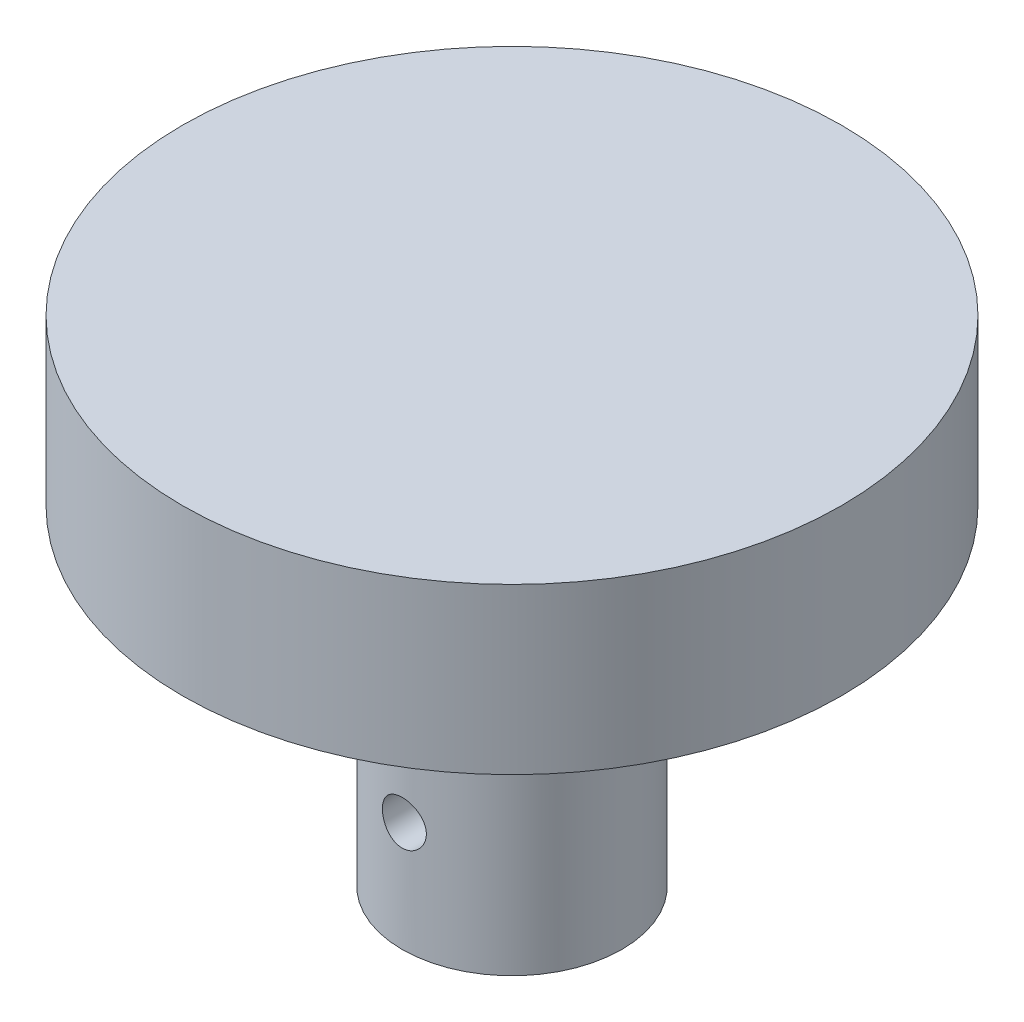
ISO-10303-21;
HEADER;
FILE_DESCRIPTION(('STEP AP214'),'2;1');
FILE_NAME('part.step','',(''),(''),'','','');
FILE_SCHEMA(('AUTOMOTIVE_DESIGN { 1 0 10303 214 1 1 1 1 }'));
ENDSEC;
DATA;
#1=APPLICATION_CONTEXT('core data for automotive mechanical design processes');
#2=APPLICATION_PROTOCOL_DEFINITION('international standard','automotive_design',2000,#1);
#3=PRODUCT_CONTEXT('',#1,'mechanical');
#4=PRODUCT('Part','Part','',(#3));
#5=PRODUCT_RELATED_PRODUCT_CATEGORY('part','',(#4));
#6=PRODUCT_DEFINITION_FORMATION('','',#4);
#7=PRODUCT_DEFINITION_CONTEXT('part definition',#1,'design');
#8=PRODUCT_DEFINITION('design','',#6,#7);
#9=PRODUCT_DEFINITION_SHAPE('','',#8);
#10=(LENGTH_UNIT() NAMED_UNIT(*) SI_UNIT(.MILLI.,.METRE.));
#11=(NAMED_UNIT(*) PLANE_ANGLE_UNIT() SI_UNIT($,.RADIAN.));
#12=(NAMED_UNIT(*) SI_UNIT($,.STERADIAN.) SOLID_ANGLE_UNIT());
#13=UNCERTAINTY_MEASURE_WITH_UNIT(LENGTH_MEASURE(1.E-05),#10,'distance_accuracy_value','');
#14=(GEOMETRIC_REPRESENTATION_CONTEXT(3) GLOBAL_UNCERTAINTY_ASSIGNED_CONTEXT((#13)) GLOBAL_UNIT_ASSIGNED_CONTEXT((#10,
#11,#12)) REPRESENTATION_CONTEXT('',''));
#15=CARTESIAN_POINT('',(0.,0.,0.));
#16=DIRECTION('',(0.,0.,1.));
#17=DIRECTION('',(1.,0.,0.));
#18=AXIS2_PLACEMENT_3D('',#15,#16,#17);
#19=CARTESIAN_POINT('',(0.,9.525,0.));
#20=DIRECTION('',(0.,-1.,0.));
#21=DIRECTION('',(0.,0.,-1.));
#22=AXIS2_PLACEMENT_3D('',#19,#20,#21);
#23=CYLINDRICAL_SURFACE('',#22,19.05);
#24=CARTESIAN_POINT('',(0.,9.525,0.));
#25=DIRECTION('',(0.,1.,0.));
#26=DIRECTION('',(0.,0.,1.));
#27=AXIS2_PLACEMENT_3D('',#24,#25,#26);
#28=CIRCLE('',#27,19.05);
#29=CARTESIAN_POINT('',(0.,9.525,19.05));
#30=VERTEX_POINT('',#29);
#31=EDGE_CURVE('E37',#30,#30,#28,.T.);
#32=ORIENTED_EDGE('',*,*,#31,.F.);
#33=EDGE_LOOP('',(#32));
#34=FACE_BOUND('',#33,.T.);
#35=CARTESIAN_POINT('',(0.,0.,0.));
#36=DIRECTION('',(0.,1.,0.));
#37=DIRECTION('',(0.,0.,1.));
#38=AXIS2_PLACEMENT_3D('',#35,#36,#37);
#39=CIRCLE('',#38,19.05);
#40=CARTESIAN_POINT('',(0.,0.,19.05));
#41=VERTEX_POINT('',#40);
#42=EDGE_CURVE('E41',#41,#41,#39,.T.);
#43=ORIENTED_EDGE('',*,*,#42,.T.);
#44=EDGE_LOOP('',(#43));
#45=FACE_BOUND('',#44,.T.);
#46=ADVANCED_FACE('F31',(#34,#45),#23,.T.);
#47=CARTESIAN_POINT('',(0.,9.525,0.));
#48=DIRECTION('',(0.,1.,0.));
#49=DIRECTION('',(0.,0.,1.));
#50=AXIS2_PLACEMENT_3D('',#47,#48,#49);
#51=PLANE('',#50);
#52=ORIENTED_EDGE('',*,*,#31,.T.);
#53=EDGE_LOOP('',(#52));
#54=FACE_BOUND('',#53,.T.);
#55=ADVANCED_FACE('F93',(#54),#51,.T.);
#56=CARTESIAN_POINT('',(0.,0.,0.));
#57=DIRECTION('',(0.,1.,0.));
#58=DIRECTION('',(0.,0.,1.));
#59=AXIS2_PLACEMENT_3D('',#56,#57,#58);
#60=PLANE('',#59);
#61=CARTESIAN_POINT('',(0.,0.,0.));
#62=DIRECTION('',(0.,1.,0.));
#63=DIRECTION('',(0.,0.,1.));
#64=AXIS2_PLACEMENT_3D('',#61,#62,#63);
#65=CIRCLE('',#64,6.35);
#66=CARTESIAN_POINT('',(0.,0.,6.35));
#67=VERTEX_POINT('',#66);
#68=EDGE_CURVE('E10',#67,#67,#65,.F.);
#69=ORIENTED_EDGE('',*,*,#68,.F.);
#70=EDGE_LOOP('',(#69));
#71=FACE_BOUND('',#70,.T.);
#72=ORIENTED_EDGE('',*,*,#42,.F.);
#73=EDGE_LOOP('',(#72));
#74=FACE_BOUND('',#73,.T.);
#75=ADVANCED_FACE('F86',(#71,#74),#60,.F.);
#76=CARTESIAN_POINT('',(0.,-19.05,0.));
#77=DIRECTION('',(0.,-1.,0.));
#78=DIRECTION('',(0.,0.,-1.));
#79=AXIS2_PLACEMENT_3D('',#76,#77,#78);
#80=PLANE('',#79);
#81=CARTESIAN_POINT('',(0.,-19.05,0.));
#82=DIRECTION('',(0.,-1.,0.));
#83=DIRECTION('',(0.,0.,-1.));
#84=AXIS2_PLACEMENT_3D('',#81,#82,#83);
#85=CIRCLE('',#84,6.35);
#86=CARTESIAN_POINT('',(0.,-19.05,-6.35));
#87=VERTEX_POINT('',#86);
#88=EDGE_CURVE('E46',#87,#87,#85,.T.);
#89=ORIENTED_EDGE('',*,*,#88,.T.);
#90=EDGE_LOOP('',(#89));
#91=FACE_BOUND('',#90,.T.);
#92=CARTESIAN_POINT('',(0.,-19.05,0.));
#93=DIRECTION('',(0.,-1.,0.));
#94=DIRECTION('',(0.,0.,-1.));
#95=AXIS2_PLACEMENT_3D('',#92,#93,#94);
#96=CIRCLE('',#95,3.5);
#97=CARTESIAN_POINT('',(0.,-19.05,-3.5));
#98=VERTEX_POINT('',#97);
#99=EDGE_CURVE('E50',#98,#98,#96,.T.);
#100=ORIENTED_EDGE('',*,*,#99,.F.);
#101=EDGE_LOOP('',(#100));
#102=FACE_BOUND('',#101,.T.);
#103=ADVANCED_FACE('F84',(#91,#102),#80,.T.);
#104=CARTESIAN_POINT('',(0.,-19.05,0.));
#105=DIRECTION('',(0.,1.,0.));
#106=DIRECTION('',(0.,0.,1.));
#107=AXIS2_PLACEMENT_3D('',#104,#105,#106);
#108=CYLINDRICAL_SURFACE('',#107,6.35);
#109=CARTESIAN_POINT('',(0.,-13.97,6.35));
#110=CARTESIAN_POINT('',(-0.0705826716266443,-13.9699974034871,6.34999869927706));
#111=CARTESIAN_POINT('',(-0.141198168455934,-13.9640959694311,6.34881109176353));
#112=CARTESIAN_POINT('',(-0.280433154765055,-13.9406649048536,6.34418804341504));
#113=CARTESIAN_POINT('',(-0.349051013277522,-13.9231260363421,6.34075081682436));
#114=CARTESIAN_POINT('',(-0.482257487684408,-13.8769835825016,6.33201234583424));
#115=CARTESIAN_POINT('',(-0.546849894275082,-13.8483905952072,6.32671288727432));
#116=CARTESIAN_POINT('',(-0.670316145857568,-13.7809830456607,6.31482605504849));
#117=CARTESIAN_POINT('',(-0.729190331146282,-13.7421690921788,6.30823875809348));
#118=CARTESIAN_POINT('',(-0.84035071618988,-13.6548641122499,6.29440149969062));
#119=CARTESIAN_POINT('',(-0.892548317971327,-13.6062613886532,6.28714446790521));
#120=CARTESIAN_POINT('',(-0.988106680892197,-13.5009986311825,6.27283709174787));
#121=CARTESIAN_POINT('',(-1.03146675185844,-13.4443379686044,6.26578676355538));
#122=CARTESIAN_POINT('',(-1.10849632675148,-13.3239304348749,6.25262201102021));
#123=CARTESIAN_POINT('',(-1.14207409235965,-13.2601237923786,6.24651668353481));
#124=CARTESIAN_POINT('',(-1.19799819655699,-13.1276320898648,6.2360336043419));
#125=CARTESIAN_POINT('',(-1.22034564469529,-13.0589475125501,6.23165568197691));
#126=CARTESIAN_POINT('',(-1.25288713085373,-12.9196028578369,6.225194626703));
#127=CARTESIAN_POINT('',(-1.26323661240765,-12.8489804689394,6.22308217036128));
#128=CARTESIAN_POINT('',(-1.27197120221217,-12.7069725268673,6.22130296326996));
#129=CARTESIAN_POINT('',(-1.27035753384615,-12.6355870524734,6.22163596244158));
#130=CARTESIAN_POINT('',(-1.25533730783931,-12.4952165792133,6.22468339958194));
#131=CARTESIAN_POINT('',(-1.24210894610976,-12.4262116148533,6.2273618513063));
#132=CARTESIAN_POINT('',(-1.20451611347127,-12.291420582638,6.23474173623202));
#133=CARTESIAN_POINT('',(-1.18015111073787,-12.2256346686729,6.23944326604379));
#134=CARTESIAN_POINT('',(-1.12080647526689,-12.0986356176364,6.25037635495518));
#135=CARTESIAN_POINT('',(-1.08575621206479,-12.0374563929472,6.25661804063405));
#136=CARTESIAN_POINT('',(-1.0060858397073,-11.9217810205345,6.26992165841789));
#137=CARTESIAN_POINT('',(-0.961464630733174,-11.867285641999,6.27698368474725));
#138=CARTESIAN_POINT('',(-0.862964916891943,-11.7654966588797,6.29128816976656));
#139=CARTESIAN_POINT('',(-0.808934324739806,-11.7183502388189,6.29853158897849));
#140=CARTESIAN_POINT('',(-0.693654980558753,-11.6337666151974,6.31226637867299));
#141=CARTESIAN_POINT('',(-0.632406135971824,-11.5963295361572,6.31875773950996));
#142=CARTESIAN_POINT('',(-0.504265421336229,-11.532200063283,6.33027296504327));
#143=CARTESIAN_POINT('',(-0.43736491087333,-11.5055244950714,6.33529452837305));
#144=CARTESIAN_POINT('',(-0.299909200089804,-11.463832197971,6.3432868941458));
#145=CARTESIAN_POINT('',(-0.229354443592011,-11.4488140567665,6.34625794500675));
#146=CARTESIAN_POINT('',(-0.0878578451464813,-11.4310713036813,6.34977993270922));
#147=CARTESIAN_POINT('',(-0.0169422169734818,-11.4281452671839,6.35037051808637));
#148=CARTESIAN_POINT('',(0.124364666424747,-11.4341273208566,6.3491751595123));
#149=CARTESIAN_POINT('',(0.194755950903618,-11.4430347457778,6.34738934915636));
#150=CARTESIAN_POINT('',(0.332366188132107,-11.4722635344008,6.34166666650182));
#151=CARTESIAN_POINT('',(0.399607974391677,-11.4924815469923,6.33774928033342));
#152=CARTESIAN_POINT('',(0.529747006924577,-11.5436446579729,6.32820111117511));
#153=CARTESIAN_POINT('',(0.592643927279676,-11.5745905600396,6.32257019982068));
#154=CARTESIAN_POINT('',(0.713157290581496,-11.6467667631272,6.31012087647284));
#155=CARTESIAN_POINT('',(0.770699660975278,-11.6881183319195,6.30328877055056));
#156=CARTESIAN_POINT('',(0.878100884281392,-11.7797696728332,6.28922713233951));
#157=CARTESIAN_POINT('',(0.927958912342069,-11.8300704043278,6.28199755749853));
#158=CARTESIAN_POINT('',(1.0193535502832,-11.9391091569017,6.26782215517346));
#159=CARTESIAN_POINT('',(1.06075188210979,-11.9979639951611,6.26088232496296));
#160=CARTESIAN_POINT('',(1.13307548346503,-12.121910428923,6.24819923581167));
#161=CARTESIAN_POINT('',(1.16400117202209,-12.1870017747584,6.24245592899945));
#162=CARTESIAN_POINT('',(1.21431283880909,-12.3212456726099,6.23286460542166));
#163=CARTESIAN_POINT('',(1.23375864473463,-12.3903750683371,6.22900678087677));
#164=CARTESIAN_POINT('',(1.26073998756654,-12.5310054859334,6.22360244725872));
#165=CARTESIAN_POINT('',(1.26827707764589,-12.6025061972859,6.22205563677712));
#166=CARTESIAN_POINT('',(1.27116955680169,-12.7444612579713,6.22146520031851));
#167=CARTESIAN_POINT('',(1.26674345085004,-12.8149110591373,6.22237667370412));
#168=CARTESIAN_POINT('',(1.24631742620708,-12.9540401953794,6.22649978325459));
#169=CARTESIAN_POINT('',(1.23031760048421,-13.0227195446724,6.22971140094305));
#170=CARTESIAN_POINT('',(1.18729578199367,-13.1562191932755,6.23805285558331));
#171=CARTESIAN_POINT('',(1.16030058353103,-13.2210484378381,6.24317802693915));
#172=CARTESIAN_POINT('',(1.09607939864404,-13.3452917253327,6.25477178017196));
#173=CARTESIAN_POINT('',(1.0588525543441,-13.4047053136309,6.26124047468595));
#174=CARTESIAN_POINT('',(0.974478511778746,-13.5175187766309,6.27492979864496));
#175=CARTESIAN_POINT('',(0.927173516788679,-13.5707993318898,6.28216133595318));
#176=CARTESIAN_POINT('',(0.82431174864669,-13.668738481022,6.29648323977382));
#177=CARTESIAN_POINT('',(0.768753081684737,-13.7133950907029,6.30357357346244));
#178=CARTESIAN_POINT('',(0.650262388942075,-13.793259997812,6.31690167132724));
#179=CARTESIAN_POINT('',(0.587259283225892,-13.8283645241656,6.32312973648443));
#180=CARTESIAN_POINT('',(0.456141278394732,-13.8874323756977,6.3339360885795));
#181=CARTESIAN_POINT('',(0.388031051296171,-13.9114057427063,6.33851586166042));
#182=CARTESIAN_POINT('',(0.266473290933201,-13.9428879740168,6.34461993196121));
#183=CARTESIAN_POINT('',(0.213717713297508,-13.9530368560089,6.34662565011234));
#184=CARTESIAN_POINT('',(0.107314397016786,-13.9665937486951,6.34931615757664));
#185=CARTESIAN_POINT('',(0.0536666868607466,-13.9700019742274,6.35000098898907));
#186=CARTESIAN_POINT('',(0.,-13.97,6.35));
#187=B_SPLINE_CURVE_WITH_KNOTS('',3,(#109,#110,#111,#112,#113,#114,#115,#116,#117,#118,#119,
#120,#121,#122,#123,#124,#125,#126,#127,#128,#129,#130,#131,#132,#133,#134,#135,#136,#137,#138,
#139,#140,#141,#142,#143,#144,#145,#146,#147,#148,#149,#150,#151,#152,#153,#154,#155,#156,#157,
#158,#159,#160,#161,#162,#163,#164,#165,#166,#167,#168,#169,#170,#171,#172,#173,#174,#175,#176,
#177,#178,#179,#180,#181,#182,#183,#184,#185,#186),.UNSPECIFIED.,.T.,.F.,(4,2,2,2,2,2,2,2,2,2,2,
2,2,2,2,2,2,2,2,2,2,2,2,2,2,2,2,2,2,2,2,2,2,2,2,2,2,2,4),(0.,0.211551685939798,
0.423271506377981,0.634788843767935,0.846293585833197,1.06036449104248,1.27445210786916,
1.49048717657522,1.70650089693801,1.91968355081556,2.13284440437156,2.34279093297974,
2.55274748852237,2.76412312558563,2.97552306532081,3.19072580664015,3.40593130775572,
3.6214719906461,3.83698655636506,4.04889634308857,4.26079421725492,4.47078676517419,
4.68079504804349,4.89337433862365,5.10597643199331,5.32181598295617,5.53764689678803,
5.75234283911558,5.96701077779627,6.17778447660981,6.38855648235613,6.5988179079145,
6.80909696828971,7.02294856823712,7.23684931256822,7.45298860778059,7.66893253507249,
7.82978844618166,7.99063923041165),.UNSPECIFIED.);
#188=CARTESIAN_POINT('',(0.,-13.97,6.35));
#189=VERTEX_POINT('',#188);
#190=EDGE_CURVE('E54',#189,#189,#187,.T.);
#191=ORIENTED_EDGE('',*,*,#190,.T.);
#192=EDGE_LOOP('',(#191));
#193=FACE_BOUND('',#192,.T.);
#194=ORIENTED_EDGE('',*,*,#88,.F.);
#195=EDGE_LOOP('',(#194));
#196=FACE_BOUND('',#195,.T.);
#197=ORIENTED_EDGE('',*,*,#68,.T.);
#198=EDGE_LOOP('',(#197));
#199=FACE_BOUND('',#198,.T.);
#200=ADVANCED_FACE('F69',(#193,#196,#199),#108,.T.);
#201=CARTESIAN_POINT('',(0.,-19.05,0.));
#202=DIRECTION('',(0.,1.,0.));
#203=DIRECTION('',(0.,0.,1.));
#204=AXIS2_PLACEMENT_3D('',#201,#202,#203);
#205=CYLINDRICAL_SURFACE('',#204,3.5);
#206=CARTESIAN_POINT('',(1.27,-12.7,3.26145672974516));
#207=CARTESIAN_POINT('',(1.27000181465599,-12.6312343705999,3.26145510475337));
#208=CARTESIAN_POINT('',(1.26439622637332,-12.5624811306927,3.26365521675541));
#209=CARTESIAN_POINT('',(1.24221592745026,-12.4270368229587,3.2721611464733));
#210=CARTESIAN_POINT('',(1.22564096274737,-12.3603458029326,3.27846705928385));
#211=CARTESIAN_POINT('',(1.1822013235172,-12.231016123262,3.29437825710922));
#212=CARTESIAN_POINT('',(1.15535990945496,-12.1683686744855,3.30397607867997));
#213=CARTESIAN_POINT('',(1.09223091445993,-12.0484426297167,3.3253779990113));
#214=CARTESIAN_POINT('',(1.05594070049789,-11.9911655363034,3.33718271249165));
#215=CARTESIAN_POINT('',(0.973137605753488,-11.8809439789651,3.36228324169193));
#216=CARTESIAN_POINT('',(0.926257636770588,-11.8282847616202,3.37562098162787));
#217=CARTESIAN_POINT('',(0.824386022333059,-11.7313764708477,3.40193364948702));
#218=CARTESIAN_POINT('',(0.769392788286585,-11.6871290483564,3.41490850576377));
#219=CARTESIAN_POINT('',(0.650714564045023,-11.6069507511715,3.4395278881934));
#220=CARTESIAN_POINT('',(0.586809975727859,-11.5713265493427,3.45111748044875));
#221=CARTESIAN_POINT('',(0.453420696634742,-11.5114509427242,3.47115961276722));
#222=CARTESIAN_POINT('',(0.383937817353689,-11.4871958632817,3.47961316625565));
#223=CARTESIAN_POINT('',(0.244360807018149,-11.451737342668,3.49213333936719));
#224=CARTESIAN_POINT('',(0.17440626737473,-11.4400435578017,3.49636427701642));
#225=CARTESIAN_POINT('',(0.0334083492754863,-11.4284720777937,3.50055026359635));
#226=CARTESIAN_POINT('',(-0.0376346909630063,-11.4285907838613,3.50050661482162));
#227=CARTESIAN_POINT('',(-0.175291727273702,-11.4403476243938,3.4962549505306));
#228=CARTESIAN_POINT('',(-0.241958348075155,-11.4514513747194,3.49224012079384));
#229=CARTESIAN_POINT('',(-0.372408288605313,-11.4839688160788,3.480747304731));
#230=CARTESIAN_POINT('',(-0.436191405613533,-11.5053832307595,3.47326907533001));
#231=CARTESIAN_POINT('',(-0.560136365738714,-11.5581810396032,3.45546326603275));
#232=CARTESIAN_POINT('',(-0.620233896235358,-11.5897017257595,3.44509671904729));
#233=CARTESIAN_POINT('',(-0.734431877692777,-11.6616985807356,3.42257251034896));
#234=CARTESIAN_POINT('',(-0.788530457708808,-11.7021775317215,3.41041429259015));
#235=CARTESIAN_POINT('',(-0.89235386377041,-11.7935531687363,3.38477785576398));
#236=CARTESIAN_POINT('',(-0.941673370493031,-11.8449010245214,3.37126381725266));
#237=CARTESIAN_POINT('',(-1.03114771058157,-11.9552311738937,3.34498342243412));
#238=CARTESIAN_POINT('',(-1.07130053473727,-12.014215136779,3.33221723049951));
#239=CARTESIAN_POINT('',(-1.1420090141623,-12.1396457507634,3.30866084190817));
#240=CARTESIAN_POINT('',(-1.17236094239833,-12.2062161022669,3.29791432278328));
#241=CARTESIAN_POINT('',(-1.22127487299369,-12.3440147586485,3.28011787501563));
#242=CARTESIAN_POINT('',(-1.23984293579293,-12.4152406483598,3.27306604652018));
#243=CARTESIAN_POINT('',(-1.26376960309745,-12.5563449302164,3.26389996243695));
#244=CARTESIAN_POINT('',(-1.26976764993177,-12.6260993103747,3.26154699292365));
#245=CARTESIAN_POINT('',(-1.27021892515644,-12.7656423894922,3.26137169411669));
#246=CARTESIAN_POINT('',(-1.26467478225629,-12.835431077019,3.26354833321414));
#247=CARTESIAN_POINT('',(-1.24277744121015,-12.9698985285657,3.27194584614148));
#248=CARTESIAN_POINT('',(-1.22690283569439,-13.0346676924255,3.277987461454));
#249=CARTESIAN_POINT('',(-1.18538882426392,-13.1605988969391,3.29322619747933));
#250=CARTESIAN_POINT('',(-1.15974749599318,-13.2217602247343,3.30242393936815));
#251=CARTESIAN_POINT('',(-1.09838967190337,-13.341176656663,3.32334526382107));
#252=CARTESIAN_POINT('',(-1.06234478179412,-13.3992488301005,3.33514761160077));
#253=CARTESIAN_POINT('',(-0.981559069912154,-13.5087488645415,3.35980997177116));
#254=CARTESIAN_POINT('',(-0.936815245019068,-13.5601744207068,3.37267034853664));
#255=CARTESIAN_POINT('',(-0.836792461675038,-13.6580476160986,3.39891172671841));
#256=CARTESIAN_POINT('',(-0.781049455454151,-13.7040262536479,3.41227901171144));
#257=CARTESIAN_POINT('',(-0.662309462668563,-13.7860251891499,3.43729871495823));
#258=CARTESIAN_POINT('',(-0.599312555296733,-13.8220455958049,3.4489511519303));
#259=CARTESIAN_POINT('',(-0.467991493224078,-13.8828323193456,3.46920338607682));
#260=CARTESIAN_POINT('',(-0.39969346157344,-13.9076501689528,3.47781712069356));
#261=CARTESIAN_POINT('',(-0.259511212700999,-13.9453172588984,3.49107441289677));
#262=CARTESIAN_POINT('',(-0.187628574904061,-13.9581717222201,3.49571970295674));
#263=CARTESIAN_POINT('',(-0.0465710477097812,-13.9710112073185,3.5003624835898));
#264=CARTESIAN_POINT('',(0.0225356537252779,-13.9716644339774,3.500601287639));
#265=CARTESIAN_POINT('',(0.159829976172857,-13.9617804099647,3.49702279324914));
#266=CARTESIAN_POINT('',(0.228017695575972,-13.9512443670647,3.49320593257911));
#267=CARTESIAN_POINT('',(0.360046132160879,-13.9197439009776,3.48204910108128));
#268=CARTESIAN_POINT('',(0.42394901595779,-13.8990103089074,3.47478723469152));
#269=CARTESIAN_POINT('',(0.54738079810756,-13.8479277800141,3.45749365938125));
#270=CARTESIAN_POINT('',(0.606908870402958,-13.817577032985,3.44746142904979));
#271=CARTESIAN_POINT('',(0.722552443899843,-13.7467103714279,3.42513184606542));
#272=CARTESIAN_POINT('',(0.778430285253109,-13.7058308607318,3.41275889307048));
#273=CARTESIAN_POINT('',(0.88274343991767,-13.6156534241217,3.38727800818542));
#274=CARTESIAN_POINT('',(0.931176160353139,-13.5663525779135,3.37416982239884));
#275=CARTESIAN_POINT('',(1.02163887407895,-13.4578778445082,3.34792201978433));
#276=CARTESIAN_POINT('',(1.06324323636225,-13.3983405456481,3.33481184338889));
#277=CARTESIAN_POINT('',(1.13585798107882,-13.2727038420461,3.31078473143181));
#278=CARTESIAN_POINT('',(1.16686852574375,-13.2066045378133,3.29986776228486));
#279=CARTESIAN_POINT('',(1.21763507308986,-13.0684634142554,3.28148035438302));
#280=CARTESIAN_POINT('',(1.23719592479841,-12.9963412305581,3.27407006819297));
#281=CARTESIAN_POINT('',(1.26337385451648,-12.8494735133787,3.26406045743574));
#282=CARTESIAN_POINT('',(1.26999802796501,-12.7747294408501,3.26145849566702));
#283=CARTESIAN_POINT('',(1.27,-12.7,3.26145672974516));
#284=B_SPLINE_CURVE_WITH_KNOTS('',3,(#206,#207,#208,#209,#210,#211,#212,#213,#214,#215,#216,
#217,#218,#219,#220,#221,#222,#223,#224,#225,#226,#227,#228,#229,#230,#231,#232,#233,#234,#235,
#236,#237,#238,#239,#240,#241,#242,#243,#244,#245,#246,#247,#248,#249,#250,#251,#252,#253,#254,
#255,#256,#257,#258,#259,#260,#261,#262,#263,#264,#265,#266,#267,#268,#269,#270,#271,#272,#273,
#274,#275,#276,#277,#278,#279,#280,#281,#282,#283),.UNSPECIFIED.,.T.,.F.,(4,2,2,2,2,2,2,2,2,2,2,
2,2,2,2,2,2,2,2,2,2,2,2,2,2,2,2,2,2,2,2,2,2,2,2,2,2,2,4),(0.,0.206019074452432,
0.412042920694562,0.617602722149849,0.823219866900925,1.03752321050572,1.25186857091657,
1.47298119244356,1.69402229804053,1.9060805915885,2.11807427970443,2.3202383168105,
2.52241654472874,2.72746679393711,2.93258081514285,3.14899823924017,3.36546305360177,
3.58617440339874,3.80677214920163,4.01584483524595,4.22486991063361,4.42484112892367,
4.62485172733122,4.8320364538692,5.03929283390237,5.25870766290649,5.47812009672456,
5.69651266349782,5.91480983950466,6.12111457420288,6.32739704259981,6.52921125541861,
6.73106347766381,6.94113500904803,7.15127953607005,7.371638265801,7.59199362085,
7.81600293375646,8.039889348708),.UNSPECIFIED.);
#285=CARTESIAN_POINT('',(1.27,-12.7,3.26145672974516));
#286=VERTEX_POINT('',#285);
#287=EDGE_CURVE('E64',#286,#286,#284,.T.);
#288=ORIENTED_EDGE('',*,*,#287,.T.);
#289=EDGE_LOOP('',(#288));
#290=FACE_BOUND('',#289,.T.);
#291=ORIENTED_EDGE('',*,*,#99,.T.);
#292=EDGE_LOOP('',(#291));
#293=FACE_BOUND('',#292,.T.);
#294=CARTESIAN_POINT('',(0.,0.,0.));
#295=DIRECTION('',(0.,-1.,0.));
#296=DIRECTION('',(0.,0.,-1.));
#297=AXIS2_PLACEMENT_3D('',#294,#295,#296);
#298=CIRCLE('',#297,3.5);
#299=CARTESIAN_POINT('',(0.,0.,-3.5));
#300=VERTEX_POINT('',#299);
#301=EDGE_CURVE('E51',#300,#300,#298,.T.);
#302=ORIENTED_EDGE('',*,*,#301,.F.);
#303=EDGE_LOOP('',(#302));
#304=FACE_BOUND('',#303,.T.);
#305=ADVANCED_FACE('F80',(#290,#293,#304),#205,.F.);
#306=ORIENTED_EDGE('',*,*,#301,.T.);
#307=EDGE_LOOP('',(#306));
#308=FACE_BOUND('',#307,.T.);
#309=ADVANCED_FACE('F77',(#308),#60,.F.);
#310=CARTESIAN_POINT('',(0.,-12.7,-19.051));
#311=DIRECTION('',(0.,0.,1.));
#312=DIRECTION('',(1.,0.,0.));
#313=AXIS2_PLACEMENT_3D('',#310,#311,#312);
#314=CYLINDRICAL_SURFACE('',#313,1.27);
#315=ORIENTED_EDGE('',*,*,#287,.F.);
#316=EDGE_LOOP('',(#315));
#317=FACE_BOUND('',#316,.T.);
#318=ORIENTED_EDGE('',*,*,#190,.F.);
#319=EDGE_LOOP('',(#318));
#320=FACE_BOUND('',#319,.T.);
#321=ADVANCED_FACE('F73',(#317,#320),#314,.F.);
#322=CLOSED_SHELL('',(#46,#55,#75,#103,#200,#305,#309,#321));
#323=MANIFOLD_SOLID_BREP('B2',#322);
#324=ADVANCED_BREP_SHAPE_REPRESENTATION('',(#18,#323),#14);
#325=SHAPE_DEFINITION_REPRESENTATION(#9,#324);
ENDSEC;
END-ISO-10303-21;
